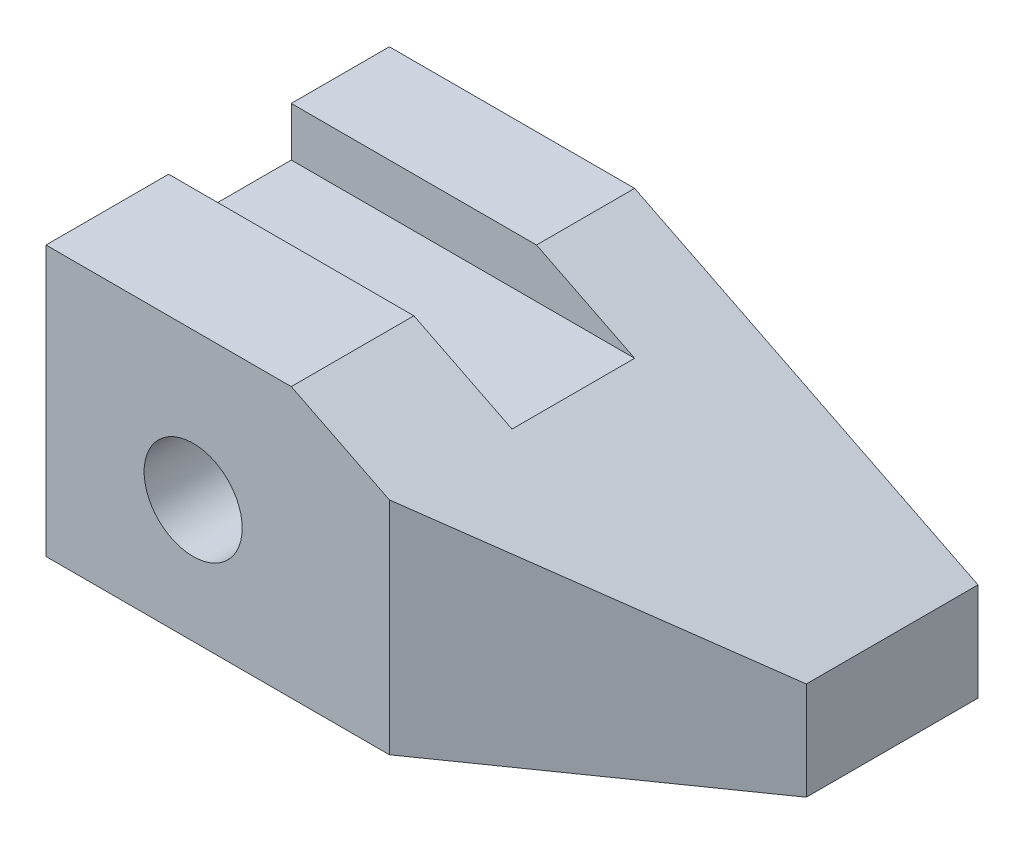
ISO-10303-21;
HEADER;
FILE_DESCRIPTION(('STEP AP214'),'2;1');
FILE_NAME('part.step','',(''),(''),'','','');
FILE_SCHEMA(('AUTOMOTIVE_DESIGN { 1 0 10303 214 1 1 1 1 }'));
ENDSEC;
DATA;
#1=APPLICATION_CONTEXT('core data for automotive mechanical design processes');
#2=APPLICATION_PROTOCOL_DEFINITION('international standard','automotive_design',2000,#1);
#3=PRODUCT_CONTEXT('',#1,'mechanical');
#4=PRODUCT('Part','Part','',(#3));
#5=PRODUCT_RELATED_PRODUCT_CATEGORY('part','',(#4));
#6=PRODUCT_DEFINITION_FORMATION('','',#4);
#7=PRODUCT_DEFINITION_CONTEXT('part definition',#1,'design');
#8=PRODUCT_DEFINITION('design','',#6,#7);
#9=PRODUCT_DEFINITION_SHAPE('','',#8);
#10=(LENGTH_UNIT() NAMED_UNIT(*) SI_UNIT(.MILLI.,.METRE.));
#11=(NAMED_UNIT(*) PLANE_ANGLE_UNIT() SI_UNIT($,.RADIAN.));
#12=(NAMED_UNIT(*) SI_UNIT($,.STERADIAN.) SOLID_ANGLE_UNIT());
#13=UNCERTAINTY_MEASURE_WITH_UNIT(LENGTH_MEASURE(1.E-05),#10,'distance_accuracy_value','');
#14=(GEOMETRIC_REPRESENTATION_CONTEXT(3) GLOBAL_UNCERTAINTY_ASSIGNED_CONTEXT((#13)) GLOBAL_UNIT_ASSIGNED_CONTEXT((#10,
#11,#12)) REPRESENTATION_CONTEXT('',''));
#15=CARTESIAN_POINT('',(0.,0.,0.));
#16=DIRECTION('',(0.,0.,1.));
#17=DIRECTION('',(1.,0.,0.));
#18=AXIS2_PLACEMENT_3D('',#15,#16,#17);
#19=CARTESIAN_POINT('',(152.4,0.,44.45));
#20=DIRECTION('',(0.,1.,0.));
#21=DIRECTION('',(-1.,0.,0.));
#22=AXIS2_PLACEMENT_3D('',#19,#20,#21);
#23=PLANE('',#22);
#24=DIRECTION('',(-0.819231920519041,0.,0.573462344363328));
#25=VECTOR('',#24,1.);
#26=CARTESIAN_POINT('',(88.9,0.,44.45));
#27=LINE('',#26,#25);
#28=CARTESIAN_POINT('',(152.4,0.,0.));
#29=VERTEX_POINT('',#28);
#30=CARTESIAN_POINT('',(88.9,0.,44.45));
#31=VERTEX_POINT('',#30);
#32=EDGE_CURVE('E115',#29,#31,#27,.T.);
#33=ORIENTED_EDGE('',*,*,#32,.T.);
#34=DIRECTION('',(1.,0.,0.));
#35=VECTOR('',#34,1.);
#36=CARTESIAN_POINT('',(152.4,0.,44.45));
#37=LINE('',#36,#35);
#38=CARTESIAN_POINT('',(0.,0.,44.45));
#39=VERTEX_POINT('',#38);
#40=EDGE_CURVE('E160',#39,#31,#37,.T.);
#41=ORIENTED_EDGE('',*,*,#40,.F.);
#42=DIRECTION('',(0.,0.,-1.));
#43=VECTOR('',#42,1.);
#44=CARTESIAN_POINT('',(0.,0.,44.45));
#45=LINE('',#44,#43);
#46=CARTESIAN_POINT('',(0.,0.,-44.45));
#47=VERTEX_POINT('',#46);
#48=EDGE_CURVE('E153',#39,#47,#45,.T.);
#49=ORIENTED_EDGE('',*,*,#48,.T.);
#50=DIRECTION('',(1.,0.,0.));
#51=VECTOR('',#50,1.);
#52=CARTESIAN_POINT('',(152.4,0.,-44.45));
#53=LINE('',#52,#51);
#54=CARTESIAN_POINT('',(152.4,0.,-44.45));
#55=VERTEX_POINT('',#54);
#56=EDGE_CURVE('E137',#47,#55,#53,.T.);
#57=ORIENTED_EDGE('',*,*,#56,.T.);
#58=DIRECTION('',(0.,0.,-1.));
#59=VECTOR('',#58,1.);
#60=CARTESIAN_POINT('',(152.4,0.,44.45));
#61=LINE('',#60,#59);
#62=EDGE_CURVE('E48',#29,#55,#61,.T.);
#63=ORIENTED_EDGE('',*,*,#62,.F.);
#64=EDGE_LOOP('',(#33,#41,#49,#57,#63));
#65=FACE_BOUND('',#64,.T.);
#66=ADVANCED_FACE('F40',(#65),#23,.F.);
#67=CARTESIAN_POINT('',(152.4,25.4,44.45));
#68=DIRECTION('',(-1.,0.,0.));
#69=DIRECTION('',(0.,0.,1.));
#70=AXIS2_PLACEMENT_3D('',#67,#68,#69);
#71=PLANE('',#70);
#72=DIRECTION('',(0.,-1.,0.));
#73=VECTOR('',#72,1.);
#74=CARTESIAN_POINT('',(152.4,69.85,0.));
#75=LINE('',#74,#73);
#76=CARTESIAN_POINT('',(152.4,25.4,0.));
#77=VERTEX_POINT('',#76);
#78=EDGE_CURVE('E118',#77,#29,#75,.T.);
#79=ORIENTED_EDGE('',*,*,#78,.T.);
#80=ORIENTED_EDGE('',*,*,#62,.T.);
#81=DIRECTION('',(0.,1.,0.));
#82=VECTOR('',#81,1.);
#83=CARTESIAN_POINT('',(152.4,25.4,-44.45));
#84=LINE('',#83,#82);
#85=CARTESIAN_POINT('',(152.4,25.4,-44.45));
#86=VERTEX_POINT('',#85);
#87=EDGE_CURVE('E169',#55,#86,#84,.T.);
#88=ORIENTED_EDGE('',*,*,#87,.T.);
#89=DIRECTION('',(0.,0.,-1.));
#90=VECTOR('',#89,1.);
#91=CARTESIAN_POINT('',(152.4,25.4,44.45));
#92=LINE('',#91,#90);
#93=EDGE_CURVE('E131',#77,#86,#92,.T.);
#94=ORIENTED_EDGE('',*,*,#93,.F.);
#95=EDGE_LOOP('',(#79,#80,#88,#94));
#96=FACE_BOUND('',#95,.T.);
#97=ADVANCED_FACE('F128',(#96),#71,.F.);
#98=CARTESIAN_POINT('',(63.5,69.85,44.45));
#99=DIRECTION('',(-0.447213595499958,-0.894427190999916,0.));
#100=DIRECTION('',(0.894427190999916,-0.447213595499958,0.));
#101=AXIS2_PLACEMENT_3D('',#98,#99,#100);
#102=PLANE('',#101);
#103=DIRECTION('',(-0.758098043578904,0.379049021789452,0.530668630505232));
#104=VECTOR('',#103,1.);
#105=CARTESIAN_POINT('',(70.6528735632184,66.2735632183908,57.2229885057471));
#106=LINE('',#105,#104);
#107=CARTESIAN_POINT('',(88.9,57.15,44.45));
#108=VERTEX_POINT('',#107);
#109=EDGE_CURVE('E54',#77,#108,#106,.T.);
#110=ORIENTED_EDGE('',*,*,#109,.F.);
#111=ORIENTED_EDGE('',*,*,#93,.T.);
#112=DIRECTION('',(-0.894427190999916,0.447213595499958,0.));
#113=VECTOR('',#112,1.);
#114=CARTESIAN_POINT('',(63.5,69.85,-44.45));
#115=LINE('',#114,#113);
#116=CARTESIAN_POINT('',(63.5,69.85,-44.45));
#117=VERTEX_POINT('',#116);
#118=EDGE_CURVE('E165',#86,#117,#115,.T.);
#119=ORIENTED_EDGE('',*,*,#118,.T.);
#120=DIRECTION('',(0.,0.,-1.));
#121=VECTOR('',#120,1.);
#122=CARTESIAN_POINT('',(63.5,69.85,44.45));
#123=LINE('',#122,#121);
#124=CARTESIAN_POINT('',(63.5,69.85,-19.05));
#125=VERTEX_POINT('',#124);
#126=EDGE_CURVE('E147',#125,#117,#123,.T.);
#127=ORIENTED_EDGE('',*,*,#126,.F.);
#128=DIRECTION('',(0.894427190999916,-0.447213595499958,0.));
#129=VECTOR('',#128,1.);
#130=CARTESIAN_POINT('',(63.5,69.85,-19.05));
#131=LINE('',#130,#129);
#132=CARTESIAN_POINT('',(88.9,57.15,-19.05));
#133=VERTEX_POINT('',#132);
#134=EDGE_CURVE('E174',#125,#133,#131,.T.);
#135=ORIENTED_EDGE('',*,*,#134,.T.);
#136=DIRECTION('',(0.,0.,-1.));
#137=VECTOR('',#136,1.);
#138=CARTESIAN_POINT('',(88.9,57.15,-19.05));
#139=LINE('',#138,#137);
#140=CARTESIAN_POINT('',(88.9,57.15,12.7));
#141=VERTEX_POINT('',#140);
#142=EDGE_CURVE('E208',#141,#133,#139,.T.);
#143=ORIENTED_EDGE('',*,*,#142,.F.);
#144=DIRECTION('',(-0.894427190999916,0.447213595499958,0.));
#145=VECTOR('',#144,1.);
#146=CARTESIAN_POINT('',(63.5,69.85,12.7));
#147=LINE('',#146,#145);
#148=CARTESIAN_POINT('',(63.5,69.85,12.7));
#149=VERTEX_POINT('',#148);
#150=EDGE_CURVE('E188',#141,#149,#147,.T.);
#151=ORIENTED_EDGE('',*,*,#150,.T.);
#152=CARTESIAN_POINT('',(63.5,69.85,44.45));
#153=VERTEX_POINT('',#152);
#154=EDGE_CURVE('E141',#153,#149,#123,.T.);
#155=ORIENTED_EDGE('',*,*,#154,.F.);
#156=DIRECTION('',(-0.894427190999916,0.447213595499958,0.));
#157=VECTOR('',#156,1.);
#158=CARTESIAN_POINT('',(88.9,57.15,44.45));
#159=LINE('',#158,#157);
#160=EDGE_CURVE('E180',#108,#153,#159,.T.);
#161=ORIENTED_EDGE('',*,*,#160,.F.);
#162=EDGE_LOOP('',(#110,#111,#119,#127,#135,#143,#151,#155,#161));
#163=FACE_BOUND('',#162,.T.);
#164=ADVANCED_FACE('F234',(#163),#102,.F.);
#165=CARTESIAN_POINT('',(0.,0.,44.45));
#166=DIRECTION('',(0.,0.,-1.));
#167=DIRECTION('',(-1.,0.,0.));
#168=AXIS2_PLACEMENT_3D('',#165,#166,#167);
#169=PLANE('',#168);
#170=CARTESIAN_POINT('',(38.1,31.75,44.45));
#171=DIRECTION('',(0.,0.,1.));
#172=DIRECTION('',(1.,0.,0.));
#173=AXIS2_PLACEMENT_3D('',#170,#171,#172);
#174=CIRCLE('',#173,12.7);
#175=CARTESIAN_POINT('',(50.8,31.75,44.45));
#176=VERTEX_POINT('',#175);
#177=EDGE_CURVE('E222',#176,#176,#174,.T.);
#178=ORIENTED_EDGE('',*,*,#177,.F.);
#179=EDGE_LOOP('',(#178));
#180=FACE_BOUND('',#179,.T.);
#181=DIRECTION('',(0.,-1.,0.));
#182=VECTOR('',#181,1.);
#183=CARTESIAN_POINT('',(88.9,0.,44.45));
#184=LINE('',#183,#182);
#185=EDGE_CURVE('E11',#108,#31,#184,.T.);
#186=ORIENTED_EDGE('',*,*,#185,.F.);
#187=ORIENTED_EDGE('',*,*,#160,.T.);
#188=DIRECTION('',(-1.,0.,0.));
#189=VECTOR('',#188,1.);
#190=CARTESIAN_POINT('',(0.,69.85,44.45));
#191=LINE('',#190,#189);
#192=CARTESIAN_POINT('',(0.,69.85,44.45));
#193=VERTEX_POINT('',#192);
#194=EDGE_CURVE('E177',#153,#193,#191,.T.);
#195=ORIENTED_EDGE('',*,*,#194,.T.);
#196=DIRECTION('',(0.,-1.,0.));
#197=VECTOR('',#196,1.);
#198=CARTESIAN_POINT('',(0.,0.,44.45));
#199=LINE('',#198,#197);
#200=EDGE_CURVE('E156',#193,#39,#199,.T.);
#201=ORIENTED_EDGE('',*,*,#200,.T.);
#202=ORIENTED_EDGE('',*,*,#40,.T.);
#203=EDGE_LOOP('',(#186,#187,#195,#201,#202));
#204=FACE_BOUND('',#203,.T.);
#205=ADVANCED_FACE('F230',(#180,#204),#169,.F.);
#206=CARTESIAN_POINT('',(0.,69.85,44.45));
#207=DIRECTION('',(0.,-1.,0.));
#208=DIRECTION('',(0.,0.,-1.));
#209=AXIS2_PLACEMENT_3D('',#206,#207,#208);
#210=PLANE('',#209);
#211=DIRECTION('',(0.,0.,-1.));
#212=VECTOR('',#211,1.);
#213=CARTESIAN_POINT('',(0.,69.85,44.45));
#214=LINE('',#213,#212);
#215=CARTESIAN_POINT('',(0.,69.85,-19.05));
#216=VERTEX_POINT('',#215);
#217=CARTESIAN_POINT('',(0.,69.85,-44.45));
#218=VERTEX_POINT('',#217);
#219=EDGE_CURVE('E152',#216,#218,#214,.T.);
#220=ORIENTED_EDGE('',*,*,#219,.F.);
#221=DIRECTION('',(-1.,0.,0.));
#222=VECTOR('',#221,1.);
#223=CARTESIAN_POINT('',(0.,69.85,-19.05));
#224=LINE('',#223,#222);
#225=EDGE_CURVE('E199',#125,#216,#224,.T.);
#226=ORIENTED_EDGE('',*,*,#225,.F.);
#227=ORIENTED_EDGE('',*,*,#126,.T.);
#228=DIRECTION('',(-1.,0.,0.));
#229=VECTOR('',#228,1.);
#230=CARTESIAN_POINT('',(0.,69.85,-44.45));
#231=LINE('',#230,#229);
#232=EDGE_CURVE('E161',#117,#218,#231,.T.);
#233=ORIENTED_EDGE('',*,*,#232,.T.);
#234=EDGE_LOOP('',(#220,#226,#227,#233));
#235=FACE_BOUND('',#234,.T.);
#236=ADVANCED_FACE('F233',(#235),#210,.F.);
#237=ORIENTED_EDGE('',*,*,#154,.T.);
#238=DIRECTION('',(1.,0.,0.));
#239=VECTOR('',#238,1.);
#240=CARTESIAN_POINT('',(0.,69.85,12.7));
#241=LINE('',#240,#239);
#242=CARTESIAN_POINT('',(0.,69.85,12.7));
#243=VERTEX_POINT('',#242);
#244=EDGE_CURVE('E203',#243,#149,#241,.T.);
#245=ORIENTED_EDGE('',*,*,#244,.F.);
#246=EDGE_CURVE('E148',#193,#243,#214,.T.);
#247=ORIENTED_EDGE('',*,*,#246,.F.);
#248=ORIENTED_EDGE('',*,*,#194,.F.);
#249=EDGE_LOOP('',(#237,#245,#247,#248));
#250=FACE_BOUND('',#249,.T.);
#251=ADVANCED_FACE('F244',(#250),#210,.F.);
#252=CARTESIAN_POINT('',(0.,0.,44.45));
#253=DIRECTION('',(1.,0.,0.));
#254=DIRECTION('',(0.,0.,-1.));
#255=AXIS2_PLACEMENT_3D('',#252,#253,#254);
#256=PLANE('',#255);
#257=DIRECTION('',(0.,0.,1.));
#258=VECTOR('',#257,1.);
#259=CARTESIAN_POINT('',(0.,57.15,-19.05));
#260=LINE('',#259,#258);
#261=CARTESIAN_POINT('',(0.,57.15,-19.05));
#262=VERTEX_POINT('',#261);
#263=CARTESIAN_POINT('',(0.,57.15,12.7));
#264=VERTEX_POINT('',#263);
#265=EDGE_CURVE('E202',#262,#264,#260,.T.);
#266=ORIENTED_EDGE('',*,*,#265,.F.);
#267=DIRECTION('',(0.,1.,0.));
#268=VECTOR('',#267,1.);
#269=CARTESIAN_POINT('',(0.,57.15,-19.05));
#270=LINE('',#269,#268);
#271=EDGE_CURVE('E192',#262,#216,#270,.T.);
#272=ORIENTED_EDGE('',*,*,#271,.T.);
#273=ORIENTED_EDGE('',*,*,#219,.T.);
#274=DIRECTION('',(0.,-1.,0.));
#275=VECTOR('',#274,1.);
#276=CARTESIAN_POINT('',(0.,0.,-44.45));
#277=LINE('',#276,#275);
#278=EDGE_CURVE('E157',#218,#47,#277,.T.);
#279=ORIENTED_EDGE('',*,*,#278,.T.);
#280=ORIENTED_EDGE('',*,*,#48,.F.);
#281=ORIENTED_EDGE('',*,*,#200,.F.);
#282=ORIENTED_EDGE('',*,*,#246,.T.);
#283=DIRECTION('',(0.,1.,0.));
#284=VECTOR('',#283,1.);
#285=CARTESIAN_POINT('',(0.,57.15,12.7));
#286=LINE('',#285,#284);
#287=EDGE_CURVE('E193',#264,#243,#286,.T.);
#288=ORIENTED_EDGE('',*,*,#287,.F.);
#289=EDGE_LOOP('',(#266,#272,#273,#279,#280,#281,#282,#288));
#290=FACE_BOUND('',#289,.T.);
#291=ADVANCED_FACE('F249',(#290),#256,.F.);
#292=CARTESIAN_POINT('',(0.,0.,-44.45));
#293=DIRECTION('',(0.,0.,-1.));
#294=DIRECTION('',(-1.,0.,0.));
#295=AXIS2_PLACEMENT_3D('',#292,#293,#294);
#296=PLANE('',#295);
#297=CARTESIAN_POINT('',(38.1,31.75,-44.45));
#298=DIRECTION('',(0.,0.,1.));
#299=DIRECTION('',(1.,0.,0.));
#300=AXIS2_PLACEMENT_3D('',#297,#298,#299);
#301=CIRCLE('',#300,12.7);
#302=CARTESIAN_POINT('',(50.8,31.75,-44.45));
#303=VERTEX_POINT('',#302);
#304=EDGE_CURVE('E124',#303,#303,#301,.T.);
#305=ORIENTED_EDGE('',*,*,#304,.T.);
#306=EDGE_LOOP('',(#305));
#307=FACE_BOUND('',#306,.T.);
#308=ORIENTED_EDGE('',*,*,#56,.F.);
#309=ORIENTED_EDGE('',*,*,#278,.F.);
#310=ORIENTED_EDGE('',*,*,#232,.F.);
#311=ORIENTED_EDGE('',*,*,#118,.F.);
#312=ORIENTED_EDGE('',*,*,#87,.F.);
#313=EDGE_LOOP('',(#308,#309,#310,#311,#312));
#314=FACE_BOUND('',#313,.T.);
#315=ADVANCED_FACE('F252',(#307,#314),#296,.T.);
#316=CARTESIAN_POINT('',(0.,57.15,-19.05));
#317=DIRECTION('',(0.,0.,-1.));
#318=DIRECTION('',(-1.,0.,0.));
#319=AXIS2_PLACEMENT_3D('',#316,#317,#318);
#320=PLANE('',#319);
#321=ORIENTED_EDGE('',*,*,#225,.T.);
#322=ORIENTED_EDGE('',*,*,#271,.F.);
#323=DIRECTION('',(-1.,0.,0.));
#324=VECTOR('',#323,1.);
#325=CARTESIAN_POINT('',(0.,57.15,-19.05));
#326=LINE('',#325,#324);
#327=EDGE_CURVE('E62',#133,#262,#326,.T.);
#328=ORIENTED_EDGE('',*,*,#327,.F.);
#329=ORIENTED_EDGE('',*,*,#134,.F.);
#330=EDGE_LOOP('',(#321,#322,#328,#329));
#331=FACE_BOUND('',#330,.T.);
#332=ADVANCED_FACE('F337',(#331),#320,.F.);
#333=CARTESIAN_POINT('',(0.,57.15,12.7));
#334=DIRECTION('',(0.,0.,1.));
#335=DIRECTION('',(1.,0.,0.));
#336=AXIS2_PLACEMENT_3D('',#333,#334,#335);
#337=PLANE('',#336);
#338=DIRECTION('',(1.,0.,0.));
#339=VECTOR('',#338,1.);
#340=CARTESIAN_POINT('',(0.,57.15,12.7));
#341=LINE('',#340,#339);
#342=EDGE_CURVE('E211',#264,#141,#341,.T.);
#343=ORIENTED_EDGE('',*,*,#342,.F.);
#344=ORIENTED_EDGE('',*,*,#287,.T.);
#345=ORIENTED_EDGE('',*,*,#244,.T.);
#346=ORIENTED_EDGE('',*,*,#150,.F.);
#347=EDGE_LOOP('',(#343,#344,#345,#346));
#348=FACE_BOUND('',#347,.T.);
#349=ADVANCED_FACE('F347',(#348),#337,.F.);
#350=CARTESIAN_POINT('',(0.,57.15,0.));
#351=DIRECTION('',(0.,1.,0.));
#352=DIRECTION('',(0.,0.,1.));
#353=AXIS2_PLACEMENT_3D('',#350,#351,#352);
#354=PLANE('',#353);
#355=ORIENTED_EDGE('',*,*,#265,.T.);
#356=ORIENTED_EDGE('',*,*,#342,.T.);
#357=ORIENTED_EDGE('',*,*,#142,.T.);
#358=ORIENTED_EDGE('',*,*,#327,.T.);
#359=EDGE_LOOP('',(#355,#356,#357,#358));
#360=FACE_BOUND('',#359,.T.);
#361=ADVANCED_FACE('F357',(#360),#354,.T.);
#362=CARTESIAN_POINT('',(88.9,69.85,44.45));
#363=DIRECTION('',(0.573462344363328,0.,0.819231920519041));
#364=DIRECTION('',(0.819231920519041,0.,-0.573462344363328));
#365=AXIS2_PLACEMENT_3D('',#362,#363,#364);
#366=PLANE('',#365);
#367=ORIENTED_EDGE('',*,*,#109,.T.);
#368=ORIENTED_EDGE('',*,*,#185,.T.);
#369=ORIENTED_EDGE('',*,*,#32,.F.);
#370=ORIENTED_EDGE('',*,*,#78,.F.);
#371=EDGE_LOOP('',(#367,#368,#369,#370));
#372=FACE_BOUND('',#371,.T.);
#373=ADVANCED_FACE('F117',(#372),#366,.T.);
#374=CARTESIAN_POINT('',(38.1,31.75,44.45));
#375=DIRECTION('',(0.,0.,1.));
#376=DIRECTION('',(1.,0.,0.));
#377=AXIS2_PLACEMENT_3D('',#374,#375,#376);
#378=CYLINDRICAL_SURFACE('',#377,12.7);
#379=ORIENTED_EDGE('',*,*,#304,.F.);
#380=EDGE_LOOP('',(#379));
#381=FACE_BOUND('',#380,.T.);
#382=ORIENTED_EDGE('',*,*,#177,.T.);
#383=EDGE_LOOP('',(#382));
#384=FACE_BOUND('',#383,.T.);
#385=ADVANCED_FACE('F228',(#381,#384),#378,.F.);
#386=CLOSED_SHELL('',(#66,#97,#164,#205,#236,#251,#291,#315,#332,#349,#361,#373,#385));
#387=MANIFOLD_SOLID_BREP('B2',#386);
#388=ADVANCED_BREP_SHAPE_REPRESENTATION('',(#18,#387),#14);
#389=SHAPE_DEFINITION_REPRESENTATION(#9,#388);
ENDSEC;
END-ISO-10303-21;
